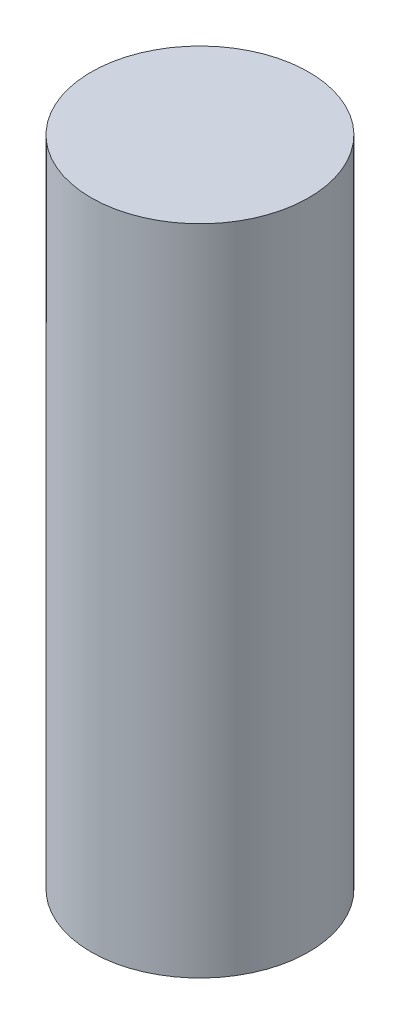
ISO-10303-21;
HEADER;
FILE_DESCRIPTION(('STEP AP214'),'2;1');
FILE_NAME('part.step','',(''),(''),'','','');
FILE_SCHEMA(('AUTOMOTIVE_DESIGN { 1 0 10303 214 1 1 1 1 }'));
ENDSEC;
DATA;
#1=APPLICATION_CONTEXT('core data for automotive mechanical design processes');
#2=APPLICATION_PROTOCOL_DEFINITION('international standard','automotive_design',2000,#1);
#3=PRODUCT_CONTEXT('',#1,'mechanical');
#4=PRODUCT('Part','Part','',(#3));
#5=PRODUCT_RELATED_PRODUCT_CATEGORY('part','',(#4));
#6=PRODUCT_DEFINITION_FORMATION('','',#4);
#7=PRODUCT_DEFINITION_CONTEXT('part definition',#1,'design');
#8=PRODUCT_DEFINITION('design','',#6,#7);
#9=PRODUCT_DEFINITION_SHAPE('','',#8);
#10=(LENGTH_UNIT() NAMED_UNIT(*) SI_UNIT(.MILLI.,.METRE.));
#11=(NAMED_UNIT(*) PLANE_ANGLE_UNIT() SI_UNIT($,.RADIAN.));
#12=(NAMED_UNIT(*) SI_UNIT($,.STERADIAN.) SOLID_ANGLE_UNIT());
#13=UNCERTAINTY_MEASURE_WITH_UNIT(LENGTH_MEASURE(1.E-05),#10,'distance_accuracy_value','');
#14=(GEOMETRIC_REPRESENTATION_CONTEXT(3) GLOBAL_UNCERTAINTY_ASSIGNED_CONTEXT((#13)) GLOBAL_UNIT_ASSIGNED_CONTEXT((#10,
#11,#12)) REPRESENTATION_CONTEXT('',''));
#15=CARTESIAN_POINT('',(0.,0.,0.));
#16=DIRECTION('',(0.,0.,1.));
#17=DIRECTION('',(1.,0.,0.));
#18=AXIS2_PLACEMENT_3D('',#15,#16,#17);
#19=CARTESIAN_POINT('',(0.,15.,0.));
#20=DIRECTION('',(0.,-1.,0.));
#21=DIRECTION('',(0.,0.,-1.));
#22=AXIS2_PLACEMENT_3D('',#19,#20,#21);
#23=CYLINDRICAL_SURFACE('',#22,2.5);
#24=CARTESIAN_POINT('',(0.,15.,0.));
#25=DIRECTION('',(0.,1.,0.));
#26=DIRECTION('',(0.,0.,1.));
#27=AXIS2_PLACEMENT_3D('',#24,#25,#26);
#28=CIRCLE('',#27,2.5);
#29=CARTESIAN_POINT('',(0.,15.,2.5));
#30=VERTEX_POINT('',#29);
#31=EDGE_CURVE('E10',#30,#30,#28,.T.);
#32=ORIENTED_EDGE('',*,*,#31,.F.);
#33=EDGE_LOOP('',(#32));
#34=FACE_BOUND('',#33,.T.);
#35=CARTESIAN_POINT('',(0.,0.,0.));
#36=DIRECTION('',(0.,1.,0.));
#37=DIRECTION('',(0.,0.,1.));
#38=AXIS2_PLACEMENT_3D('',#35,#36,#37);
#39=CIRCLE('',#38,2.5);
#40=CARTESIAN_POINT('',(0.,0.,2.5));
#41=VERTEX_POINT('',#40);
#42=EDGE_CURVE('E34',#41,#41,#39,.T.);
#43=ORIENTED_EDGE('',*,*,#42,.T.);
#44=EDGE_LOOP('',(#43));
#45=FACE_BOUND('',#44,.T.);
#46=ADVANCED_FACE('F31',(#34,#45),#23,.T.);
#47=CARTESIAN_POINT('',(0.,15.,0.));
#48=DIRECTION('',(0.,1.,0.));
#49=DIRECTION('',(0.,0.,1.));
#50=AXIS2_PLACEMENT_3D('',#47,#48,#49);
#51=PLANE('',#50);
#52=ORIENTED_EDGE('',*,*,#31,.T.);
#53=EDGE_LOOP('',(#52));
#54=FACE_BOUND('',#53,.T.);
#55=ADVANCED_FACE('F46',(#54),#51,.T.);
#56=CARTESIAN_POINT('',(0.,0.,0.));
#57=DIRECTION('',(0.,1.,0.));
#58=DIRECTION('',(0.,0.,1.));
#59=AXIS2_PLACEMENT_3D('',#56,#57,#58);
#60=PLANE('',#59);
#61=ORIENTED_EDGE('',*,*,#42,.F.);
#62=EDGE_LOOP('',(#61));
#63=FACE_BOUND('',#62,.T.);
#64=ADVANCED_FACE('F44',(#63),#60,.F.);
#65=CLOSED_SHELL('',(#46,#55,#64));
#66=MANIFOLD_SOLID_BREP('B2',#65);
#67=ADVANCED_BREP_SHAPE_REPRESENTATION('',(#18,#66),#14);
#68=SHAPE_DEFINITION_REPRESENTATION(#9,#67);
ENDSEC;
END-ISO-10303-21;
